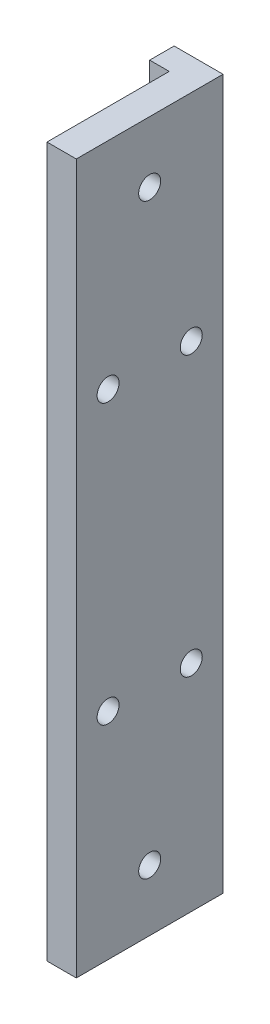
ISO-10303-21;
HEADER;
FILE_DESCRIPTION(('STEP AP214'),'2;1');
FILE_NAME('part.step','',(''),(''),'','','');
FILE_SCHEMA(('AUTOMOTIVE_DESIGN { 1 0 10303 214 1 1 1 1 }'));
ENDSEC;
DATA;
#1=APPLICATION_CONTEXT('core data for automotive mechanical design processes');
#2=APPLICATION_PROTOCOL_DEFINITION('international standard','automotive_design',2000,#1);
#3=PRODUCT_CONTEXT('',#1,'mechanical');
#4=PRODUCT('Part','Part','',(#3));
#5=PRODUCT_RELATED_PRODUCT_CATEGORY('part','',(#4));
#6=PRODUCT_DEFINITION_FORMATION('','',#4);
#7=PRODUCT_DEFINITION_CONTEXT('part definition',#1,'design');
#8=PRODUCT_DEFINITION('design','',#6,#7);
#9=PRODUCT_DEFINITION_SHAPE('','',#8);
#10=(LENGTH_UNIT() NAMED_UNIT(*) SI_UNIT(.MILLI.,.METRE.));
#11=(NAMED_UNIT(*) PLANE_ANGLE_UNIT() SI_UNIT($,.RADIAN.));
#12=(NAMED_UNIT(*) SI_UNIT($,.STERADIAN.) SOLID_ANGLE_UNIT());
#13=UNCERTAINTY_MEASURE_WITH_UNIT(LENGTH_MEASURE(1.E-05),#10,'distance_accuracy_value','');
#14=(GEOMETRIC_REPRESENTATION_CONTEXT(3) GLOBAL_UNCERTAINTY_ASSIGNED_CONTEXT((#13)) GLOBAL_UNIT_ASSIGNED_CONTEXT((#10,
#11,#12)) REPRESENTATION_CONTEXT('',''));
#15=CARTESIAN_POINT('',(0.,0.,0.));
#16=DIRECTION('',(0.,0.,1.));
#17=DIRECTION('',(1.,0.,0.));
#18=AXIS2_PLACEMENT_3D('',#15,#16,#17);
#19=CARTESIAN_POINT('',(-67.5000000000001,115.,102.5));
#20=DIRECTION('',(1.,0.,0.));
#21=DIRECTION('',(0.,0.,-1.));
#22=AXIS2_PLACEMENT_3D('',#19,#20,#21);
#23=PLANE('',#22);
#24=CARTESIAN_POINT('',(-67.5000000000001,159.,121.));
#25=DIRECTION('',(1.,0.,0.));
#26=DIRECTION('',(0.,0.,-1.));
#27=AXIS2_PLACEMENT_3D('',#24,#25,#26);
#28=CIRCLE('',#27,2.25);
#29=CARTESIAN_POINT('',(-67.5000000000001,159.,118.75));
#30=VERTEX_POINT('',#29);
#31=EDGE_CURVE('E180',#30,#30,#28,.T.);
#32=ORIENTED_EDGE('',*,*,#31,.T.);
#33=EDGE_LOOP('',(#32));
#34=FACE_BOUND('',#33,.T.);
#35=CARTESIAN_POINT('',(-67.5000000000001,216.,121.));
#36=DIRECTION('',(1.,0.,0.));
#37=DIRECTION('',(0.,0.,-1.));
#38=AXIS2_PLACEMENT_3D('',#35,#36,#37);
#39=CIRCLE('',#38,2.25);
#40=CARTESIAN_POINT('',(-67.5000000000001,216.,118.75));
#41=VERTEX_POINT('',#40);
#42=EDGE_CURVE('E214',#41,#41,#39,.T.);
#43=ORIENTED_EDGE('',*,*,#42,.T.);
#44=EDGE_LOOP('',(#43));
#45=FACE_BOUND('',#44,.T.);
#46=CARTESIAN_POINT('',(-67.5000000000001,247.5,112.5));
#47=DIRECTION('',(1.,0.,0.));
#48=DIRECTION('',(0.,0.,-1.));
#49=AXIS2_PLACEMENT_3D('',#46,#47,#48);
#50=CIRCLE('',#49,2.25);
#51=CARTESIAN_POINT('',(-67.5000000000001,247.5,110.25));
#52=VERTEX_POINT('',#51);
#53=EDGE_CURVE('E190',#52,#52,#50,.T.);
#54=ORIENTED_EDGE('',*,*,#53,.T.);
#55=EDGE_LOOP('',(#54));
#56=FACE_BOUND('',#55,.T.);
#57=CARTESIAN_POINT('',(-67.5000000000001,127.5,112.5));
#58=DIRECTION('',(1.,0.,0.));
#59=DIRECTION('',(0.,0.,-1.));
#60=AXIS2_PLACEMENT_3D('',#57,#58,#59);
#61=CIRCLE('',#60,2.25);
#62=CARTESIAN_POINT('',(-67.5000000000001,127.5,110.25));
#63=VERTEX_POINT('',#62);
#64=EDGE_CURVE('E44',#63,#63,#61,.T.);
#65=ORIENTED_EDGE('',*,*,#64,.T.);
#66=EDGE_LOOP('',(#65));
#67=FACE_BOUND('',#66,.T.);
#68=DIRECTION('',(0.,1.,0.));
#69=VECTOR('',#68,1.);
#70=CARTESIAN_POINT('',(-67.5000000000001,115.,102.5));
#71=LINE('',#70,#69);
#72=CARTESIAN_POINT('',(-67.5000000000001,217.677050983125,102.5));
#73=VERTEX_POINT('',#72);
#74=CARTESIAN_POINT('',(-67.5000000000001,260.,102.5));
#75=VERTEX_POINT('',#74);
#76=EDGE_CURVE('E50',#73,#75,#71,.T.);
#77=ORIENTED_EDGE('',*,*,#76,.F.);
#78=CARTESIAN_POINT('',(-67.5000000000001,216.,104.));
#79=DIRECTION('',(1.,0.,0.));
#80=DIRECTION('',(0.,0.,-1.));
#81=AXIS2_PLACEMENT_3D('',#78,#79,#80);
#82=CIRCLE('',#81,2.25);
#83=CARTESIAN_POINT('',(-67.5000000000001,214.322949016875,102.5));
#84=VERTEX_POINT('',#83);
#85=EDGE_CURVE('E56',#73,#84,#82,.T.);
#86=ORIENTED_EDGE('',*,*,#85,.T.);
#87=CARTESIAN_POINT('',(-67.5000000000001,160.677050983125,102.5));
#88=VERTEX_POINT('',#87);
#89=EDGE_CURVE('E166',#88,#84,#71,.T.);
#90=ORIENTED_EDGE('',*,*,#89,.F.);
#91=CARTESIAN_POINT('',(-67.5000000000001,159.,104.));
#92=DIRECTION('',(1.,0.,0.));
#93=DIRECTION('',(0.,0.,-1.));
#94=AXIS2_PLACEMENT_3D('',#91,#92,#93);
#95=CIRCLE('',#94,2.25);
#96=CARTESIAN_POINT('',(-67.5000000000001,157.322949016875,102.5));
#97=VERTEX_POINT('',#96);
#98=EDGE_CURVE('E63',#88,#97,#95,.T.);
#99=ORIENTED_EDGE('',*,*,#98,.T.);
#100=CARTESIAN_POINT('',(-67.5000000000001,115.,102.5));
#101=VERTEX_POINT('',#100);
#102=EDGE_CURVE('E11',#101,#97,#71,.T.);
#103=ORIENTED_EDGE('',*,*,#102,.F.);
#104=DIRECTION('',(0.,0.,-1.));
#105=VECTOR('',#104,1.);
#106=CARTESIAN_POINT('',(-67.5000000000001,115.,102.5));
#107=LINE('',#106,#105);
#108=CARTESIAN_POINT('',(-67.5000000000001,115.,127.5));
#109=VERTEX_POINT('',#108);
#110=EDGE_CURVE('E109',#109,#101,#107,.T.);
#111=ORIENTED_EDGE('',*,*,#110,.F.);
#112=DIRECTION('',(0.,1.,0.));
#113=VECTOR('',#112,1.);
#114=CARTESIAN_POINT('',(-67.5,115.,127.5));
#115=LINE('',#114,#113);
#116=CARTESIAN_POINT('',(-67.5,260.,127.5));
#117=VERTEX_POINT('',#116);
#118=EDGE_CURVE('E113',#109,#117,#115,.T.);
#119=ORIENTED_EDGE('',*,*,#118,.T.);
#120=DIRECTION('',(0.,0.,-1.));
#121=VECTOR('',#120,1.);
#122=CARTESIAN_POINT('',(-67.5000000000001,260.,102.5));
#123=LINE('',#122,#121);
#124=EDGE_CURVE('E141',#117,#75,#123,.T.);
#125=ORIENTED_EDGE('',*,*,#124,.T.);
#126=EDGE_LOOP('',(#77,#86,#90,#99,#103,#111,#119,#125));
#127=FACE_BOUND('',#126,.T.);
#128=ADVANCED_FACE('F41',(#34,#45,#56,#67,#127),#23,.F.);
#129=CARTESIAN_POINT('',(-71.5000000000001,115.,102.5));
#130=DIRECTION('',(0.,0.,-1.));
#131=DIRECTION('',(-1.,0.,0.));
#132=AXIS2_PLACEMENT_3D('',#129,#130,#131);
#133=PLANE('',#132);
#134=DIRECTION('',(-1.,0.,0.));
#135=VECTOR('',#134,1.);
#136=CARTESIAN_POINT('',(-71.5000000000001,260.,102.5));
#137=LINE('',#136,#135);
#138=CARTESIAN_POINT('',(-71.5000000000001,260.,102.5));
#139=VERTEX_POINT('',#138);
#140=EDGE_CURVE('E143',#75,#139,#137,.T.);
#141=ORIENTED_EDGE('',*,*,#140,.T.);
#142=DIRECTION('',(0.,1.,0.));
#143=VECTOR('',#142,1.);
#144=CARTESIAN_POINT('',(-71.5000000000001,115.,102.5));
#145=LINE('',#144,#143);
#146=CARTESIAN_POINT('',(-71.5000000000001,115.,102.5));
#147=VERTEX_POINT('',#146);
#148=EDGE_CURVE('E157',#147,#139,#145,.T.);
#149=ORIENTED_EDGE('',*,*,#148,.F.);
#150=DIRECTION('',(-1.,0.,0.));
#151=VECTOR('',#150,1.);
#152=CARTESIAN_POINT('',(-71.5000000000001,115.,102.5));
#153=LINE('',#152,#151);
#154=EDGE_CURVE('E118',#101,#147,#153,.T.);
#155=ORIENTED_EDGE('',*,*,#154,.F.);
#156=ORIENTED_EDGE('',*,*,#102,.T.);
#157=EDGE_CURVE('E49',#97,#88,#71,.T.);
#158=ORIENTED_EDGE('',*,*,#157,.T.);
#159=ORIENTED_EDGE('',*,*,#89,.T.);
#160=EDGE_CURVE('E163',#84,#73,#71,.T.);
#161=ORIENTED_EDGE('',*,*,#160,.T.);
#162=ORIENTED_EDGE('',*,*,#76,.T.);
#163=EDGE_LOOP('',(#141,#149,#155,#156,#158,#159,#161,#162));
#164=FACE_BOUND('',#163,.T.);
#165=ADVANCED_FACE('F170',(#164),#133,.F.);
#166=CARTESIAN_POINT('',(-71.5000000000001,115.,97.5));
#167=DIRECTION('',(1.,0.,0.));
#168=DIRECTION('',(0.,0.,-1.));
#169=AXIS2_PLACEMENT_3D('',#166,#167,#168);
#170=PLANE('',#169);
#171=DIRECTION('',(0.,0.,-1.));
#172=VECTOR('',#171,1.);
#173=CARTESIAN_POINT('',(-71.5000000000001,260.,97.5));
#174=LINE('',#173,#172);
#175=CARTESIAN_POINT('',(-71.5000000000001,260.,97.5));
#176=VERTEX_POINT('',#175);
#177=EDGE_CURVE('E145',#139,#176,#174,.T.);
#178=ORIENTED_EDGE('',*,*,#177,.T.);
#179=DIRECTION('',(0.,1.,0.));
#180=VECTOR('',#179,1.);
#181=CARTESIAN_POINT('',(-71.5000000000001,115.,97.5));
#182=LINE('',#181,#180);
#183=CARTESIAN_POINT('',(-71.5000000000001,115.,97.5));
#184=VERTEX_POINT('',#183);
#185=EDGE_CURVE('E154',#184,#176,#182,.T.);
#186=ORIENTED_EDGE('',*,*,#185,.F.);
#187=DIRECTION('',(0.,0.,-1.));
#188=VECTOR('',#187,1.);
#189=CARTESIAN_POINT('',(-71.5000000000001,115.,97.5));
#190=LINE('',#189,#188);
#191=EDGE_CURVE('E197',#147,#184,#190,.T.);
#192=ORIENTED_EDGE('',*,*,#191,.F.);
#193=ORIENTED_EDGE('',*,*,#148,.T.);
#194=EDGE_LOOP('',(#178,#186,#192,#193));
#195=FACE_BOUND('',#194,.T.);
#196=ADVANCED_FACE('F247',(#195),#170,.F.);
#197=CARTESIAN_POINT('',(-61.5000000000001,115.,97.5));
#198=DIRECTION('',(0.,0.,1.));
#199=DIRECTION('',(1.,0.,0.));
#200=AXIS2_PLACEMENT_3D('',#197,#198,#199);
#201=PLANE('',#200);
#202=DIRECTION('',(1.,0.,0.));
#203=VECTOR('',#202,1.);
#204=CARTESIAN_POINT('',(-61.5000000000001,260.,97.5));
#205=LINE('',#204,#203);
#206=CARTESIAN_POINT('',(-61.5000000000001,260.,97.5));
#207=VERTEX_POINT('',#206);
#208=EDGE_CURVE('E147',#176,#207,#205,.T.);
#209=ORIENTED_EDGE('',*,*,#208,.T.);
#210=DIRECTION('',(0.,1.,0.));
#211=VECTOR('',#210,1.);
#212=CARTESIAN_POINT('',(-61.5000000000001,115.,97.5));
#213=LINE('',#212,#211);
#214=CARTESIAN_POINT('',(-61.5000000000001,115.,97.5));
#215=VERTEX_POINT('',#214);
#216=EDGE_CURVE('E135',#215,#207,#213,.T.);
#217=ORIENTED_EDGE('',*,*,#216,.F.);
#218=DIRECTION('',(1.,0.,0.));
#219=VECTOR('',#218,1.);
#220=CARTESIAN_POINT('',(-61.5000000000001,115.,97.5));
#221=LINE('',#220,#219);
#222=EDGE_CURVE('E137',#184,#215,#221,.T.);
#223=ORIENTED_EDGE('',*,*,#222,.F.);
#224=ORIENTED_EDGE('',*,*,#185,.T.);
#225=EDGE_LOOP('',(#209,#217,#223,#224));
#226=FACE_BOUND('',#225,.T.);
#227=ADVANCED_FACE('F202',(#226),#201,.F.);
#228=CARTESIAN_POINT('',(-61.5000000000001,115.,127.5));
#229=DIRECTION('',(-1.,0.,0.));
#230=DIRECTION('',(0.,0.,1.));
#231=AXIS2_PLACEMENT_3D('',#228,#229,#230);
#232=PLANE('',#231);
#233=CARTESIAN_POINT('',(-61.5000000000001,216.,104.));
#234=DIRECTION('',(1.,0.,0.));
#235=DIRECTION('',(0.,0.,-1.));
#236=AXIS2_PLACEMENT_3D('',#233,#234,#235);
#237=CIRCLE('',#236,2.25);
#238=CARTESIAN_POINT('',(-61.5000000000001,216.,101.75));
#239=VERTEX_POINT('',#238);
#240=EDGE_CURVE('E127',#239,#239,#237,.T.);
#241=ORIENTED_EDGE('',*,*,#240,.F.);
#242=EDGE_LOOP('',(#241));
#243=FACE_BOUND('',#242,.T.);
#244=CARTESIAN_POINT('',(-61.5000000000001,216.,121.));
#245=DIRECTION('',(1.,0.,0.));
#246=DIRECTION('',(0.,0.,-1.));
#247=AXIS2_PLACEMENT_3D('',#244,#245,#246);
#248=CIRCLE('',#247,2.25);
#249=CARTESIAN_POINT('',(-61.5000000000001,216.,118.75));
#250=VERTEX_POINT('',#249);
#251=EDGE_CURVE('E210',#250,#250,#248,.T.);
#252=ORIENTED_EDGE('',*,*,#251,.F.);
#253=EDGE_LOOP('',(#252));
#254=FACE_BOUND('',#253,.T.);
#255=CARTESIAN_POINT('',(-61.5000000000001,159.,104.));
#256=DIRECTION('',(1.,0.,0.));
#257=DIRECTION('',(0.,0.,-1.));
#258=AXIS2_PLACEMENT_3D('',#255,#256,#257);
#259=CIRCLE('',#258,2.25);
#260=CARTESIAN_POINT('',(-61.5000000000001,159.,101.75));
#261=VERTEX_POINT('',#260);
#262=EDGE_CURVE('E176',#261,#261,#259,.T.);
#263=ORIENTED_EDGE('',*,*,#262,.F.);
#264=EDGE_LOOP('',(#263));
#265=FACE_BOUND('',#264,.T.);
#266=CARTESIAN_POINT('',(-61.5000000000001,159.,121.));
#267=DIRECTION('',(1.,0.,0.));
#268=DIRECTION('',(0.,0.,-1.));
#269=AXIS2_PLACEMENT_3D('',#266,#267,#268);
#270=CIRCLE('',#269,2.25);
#271=CARTESIAN_POINT('',(-61.5000000000001,159.,118.75));
#272=VERTEX_POINT('',#271);
#273=EDGE_CURVE('E178',#272,#272,#270,.T.);
#274=ORIENTED_EDGE('',*,*,#273,.F.);
#275=EDGE_LOOP('',(#274));
#276=FACE_BOUND('',#275,.T.);
#277=CARTESIAN_POINT('',(-61.5000000000001,247.5,112.5));
#278=DIRECTION('',(1.,0.,0.));
#279=DIRECTION('',(0.,0.,-1.));
#280=AXIS2_PLACEMENT_3D('',#277,#278,#279);
#281=CIRCLE('',#280,2.25);
#282=CARTESIAN_POINT('',(-61.5000000000001,247.5,110.25));
#283=VERTEX_POINT('',#282);
#284=EDGE_CURVE('E187',#283,#283,#281,.T.);
#285=ORIENTED_EDGE('',*,*,#284,.F.);
#286=EDGE_LOOP('',(#285));
#287=FACE_BOUND('',#286,.T.);
#288=CARTESIAN_POINT('',(-61.5000000000001,127.5,112.5));
#289=DIRECTION('',(1.,0.,0.));
#290=DIRECTION('',(0.,0.,-1.));
#291=AXIS2_PLACEMENT_3D('',#288,#289,#290);
#292=CIRCLE('',#291,2.25);
#293=CARTESIAN_POINT('',(-61.5000000000001,127.5,110.25));
#294=VERTEX_POINT('',#293);
#295=EDGE_CURVE('E193',#294,#294,#292,.T.);
#296=ORIENTED_EDGE('',*,*,#295,.F.);
#297=EDGE_LOOP('',(#296));
#298=FACE_BOUND('',#297,.T.);
#299=DIRECTION('',(0.,0.,1.));
#300=VECTOR('',#299,1.);
#301=CARTESIAN_POINT('',(-61.5000000000001,260.,127.5));
#302=LINE('',#301,#300);
#303=CARTESIAN_POINT('',(-61.5000000000001,260.,127.5));
#304=VERTEX_POINT('',#303);
#305=EDGE_CURVE('E149',#207,#304,#302,.T.);
#306=ORIENTED_EDGE('',*,*,#305,.T.);
#307=DIRECTION('',(0.,1.,0.));
#308=VECTOR('',#307,1.);
#309=CARTESIAN_POINT('',(-61.5000000000001,115.,127.5));
#310=LINE('',#309,#308);
#311=CARTESIAN_POINT('',(-61.5000000000001,115.,127.5));
#312=VERTEX_POINT('',#311);
#313=EDGE_CURVE('E133',#312,#304,#310,.T.);
#314=ORIENTED_EDGE('',*,*,#313,.F.);
#315=DIRECTION('',(0.,0.,1.));
#316=VECTOR('',#315,1.);
#317=CARTESIAN_POINT('',(-61.5000000000001,115.,127.5));
#318=LINE('',#317,#316);
#319=EDGE_CURVE('E131',#215,#312,#318,.T.);
#320=ORIENTED_EDGE('',*,*,#319,.F.);
#321=ORIENTED_EDGE('',*,*,#216,.T.);
#322=EDGE_LOOP('',(#306,#314,#320,#321));
#323=FACE_BOUND('',#322,.T.);
#324=ADVANCED_FACE('F206',(#243,#254,#265,#276,#287,#298,#323),#232,.F.);
#325=CARTESIAN_POINT('',(-71.5,115.,127.5));
#326=DIRECTION('',(0.,0.,-1.));
#327=DIRECTION('',(-1.,0.,0.));
#328=AXIS2_PLACEMENT_3D('',#325,#326,#327);
#329=PLANE('',#328);
#330=DIRECTION('',(-1.,0.,0.));
#331=VECTOR('',#330,1.);
#332=CARTESIAN_POINT('',(-71.5,260.,127.5));
#333=LINE('',#332,#331);
#334=EDGE_CURVE('E119',#304,#117,#333,.T.);
#335=ORIENTED_EDGE('',*,*,#334,.T.);
#336=ORIENTED_EDGE('',*,*,#118,.F.);
#337=DIRECTION('',(-1.,0.,0.));
#338=VECTOR('',#337,1.);
#339=CARTESIAN_POINT('',(-71.5,115.,127.5));
#340=LINE('',#339,#338);
#341=EDGE_CURVE('E125',#312,#109,#340,.T.);
#342=ORIENTED_EDGE('',*,*,#341,.F.);
#343=ORIENTED_EDGE('',*,*,#313,.T.);
#344=EDGE_LOOP('',(#335,#336,#342,#343));
#345=FACE_BOUND('',#344,.T.);
#346=ADVANCED_FACE('F123',(#345),#329,.F.);
#347=CARTESIAN_POINT('',(0.,115.,0.));
#348=DIRECTION('',(0.,1.,0.));
#349=DIRECTION('',(0.,0.,1.));
#350=AXIS2_PLACEMENT_3D('',#347,#348,#349);
#351=PLANE('',#350);
#352=ORIENTED_EDGE('',*,*,#341,.T.);
#353=ORIENTED_EDGE('',*,*,#110,.T.);
#354=ORIENTED_EDGE('',*,*,#154,.T.);
#355=ORIENTED_EDGE('',*,*,#191,.T.);
#356=ORIENTED_EDGE('',*,*,#222,.T.);
#357=ORIENTED_EDGE('',*,*,#319,.T.);
#358=EDGE_LOOP('',(#352,#353,#354,#355,#356,#357));
#359=FACE_BOUND('',#358,.T.);
#360=ADVANCED_FACE('F129',(#359),#351,.F.);
#361=CARTESIAN_POINT('',(0.,260.,0.));
#362=DIRECTION('',(0.,1.,0.));
#363=DIRECTION('',(0.,0.,1.));
#364=AXIS2_PLACEMENT_3D('',#361,#362,#363);
#365=PLANE('',#364);
#366=ORIENTED_EDGE('',*,*,#124,.F.);
#367=ORIENTED_EDGE('',*,*,#334,.F.);
#368=ORIENTED_EDGE('',*,*,#305,.F.);
#369=ORIENTED_EDGE('',*,*,#208,.F.);
#370=ORIENTED_EDGE('',*,*,#177,.F.);
#371=ORIENTED_EDGE('',*,*,#140,.F.);
#372=EDGE_LOOP('',(#366,#367,#368,#369,#370,#371));
#373=FACE_BOUND('',#372,.T.);
#374=ADVANCED_FACE('F208',(#373),#365,.T.);
#375=CARTESIAN_POINT('',(-61.5000000000001,127.5,112.5));
#376=DIRECTION('',(1.,0.,0.));
#377=DIRECTION('',(0.,0.,-1.));
#378=AXIS2_PLACEMENT_3D('',#375,#376,#377);
#379=CYLINDRICAL_SURFACE('',#378,2.25);
#380=ORIENTED_EDGE('',*,*,#295,.T.);
#381=EDGE_LOOP('',(#380));
#382=FACE_BOUND('',#381,.T.);
#383=ORIENTED_EDGE('',*,*,#64,.F.);
#384=EDGE_LOOP('',(#383));
#385=FACE_BOUND('',#384,.T.);
#386=ADVANCED_FACE('F233',(#382,#385),#379,.F.);
#387=CARTESIAN_POINT('',(-61.5000000000001,247.5,112.5));
#388=DIRECTION('',(1.,0.,0.));
#389=DIRECTION('',(0.,0.,-1.));
#390=AXIS2_PLACEMENT_3D('',#387,#388,#389);
#391=CYLINDRICAL_SURFACE('',#390,2.25);
#392=ORIENTED_EDGE('',*,*,#284,.T.);
#393=EDGE_LOOP('',(#392));
#394=FACE_BOUND('',#393,.T.);
#395=ORIENTED_EDGE('',*,*,#53,.F.);
#396=EDGE_LOOP('',(#395));
#397=FACE_BOUND('',#396,.T.);
#398=ADVANCED_FACE('F236',(#394,#397),#391,.F.);
#399=CARTESIAN_POINT('',(-61.5000000000001,159.,121.));
#400=DIRECTION('',(1.,0.,0.));
#401=DIRECTION('',(0.,0.,-1.));
#402=AXIS2_PLACEMENT_3D('',#399,#400,#401);
#403=CYLINDRICAL_SURFACE('',#402,2.25);
#404=ORIENTED_EDGE('',*,*,#31,.F.);
#405=EDGE_LOOP('',(#404));
#406=FACE_BOUND('',#405,.T.);
#407=ORIENTED_EDGE('',*,*,#273,.T.);
#408=EDGE_LOOP('',(#407));
#409=FACE_BOUND('',#408,.T.);
#410=ADVANCED_FACE('F253',(#406,#409),#403,.F.);
#411=CARTESIAN_POINT('',(-67.5000000000001,159.,104.));
#412=DIRECTION('',(-1.,0.,0.));
#413=DIRECTION('',(0.,0.,1.));
#414=AXIS2_PLACEMENT_3D('',#411,#412,#413);
#415=PLANE('',#414);
#416=EDGE_CURVE('E173',#97,#88,#95,.T.);
#417=ORIENTED_EDGE('',*,*,#416,.T.);
#418=ORIENTED_EDGE('',*,*,#157,.F.);
#419=EDGE_LOOP('',(#417,#418));
#420=FACE_BOUND('',#419,.T.);
#421=ADVANCED_FACE('F172',(#420),#415,.F.);
#422=CARTESIAN_POINT('',(-61.5000000000001,159.,104.));
#423=DIRECTION('',(1.,0.,0.));
#424=DIRECTION('',(0.,0.,-1.));
#425=AXIS2_PLACEMENT_3D('',#422,#423,#424);
#426=CYLINDRICAL_SURFACE('',#425,2.25);
#427=ORIENTED_EDGE('',*,*,#98,.F.);
#428=ORIENTED_EDGE('',*,*,#416,.F.);
#429=EDGE_LOOP('',(#427,#428));
#430=FACE_BOUND('',#429,.T.);
#431=ORIENTED_EDGE('',*,*,#262,.T.);
#432=EDGE_LOOP('',(#431));
#433=FACE_BOUND('',#432,.T.);
#434=ADVANCED_FACE('F174',(#430,#433),#426,.F.);
#435=CARTESIAN_POINT('',(-61.5000000000001,216.,121.));
#436=DIRECTION('',(1.,0.,0.));
#437=DIRECTION('',(0.,0.,-1.));
#438=AXIS2_PLACEMENT_3D('',#435,#436,#437);
#439=CYLINDRICAL_SURFACE('',#438,2.25);
#440=ORIENTED_EDGE('',*,*,#42,.F.);
#441=EDGE_LOOP('',(#440));
#442=FACE_BOUND('',#441,.T.);
#443=ORIENTED_EDGE('',*,*,#251,.T.);
#444=EDGE_LOOP('',(#443));
#445=FACE_BOUND('',#444,.T.);
#446=ADVANCED_FACE('F343',(#442,#445),#439,.F.);
#447=CARTESIAN_POINT('',(-67.5000000000001,216.,104.));
#448=DIRECTION('',(-1.,0.,0.));
#449=DIRECTION('',(0.,0.,1.));
#450=AXIS2_PLACEMENT_3D('',#447,#448,#449);
#451=PLANE('',#450);
#452=EDGE_CURVE('E211',#84,#73,#82,.T.);
#453=ORIENTED_EDGE('',*,*,#452,.T.);
#454=ORIENTED_EDGE('',*,*,#160,.F.);
#455=EDGE_LOOP('',(#453,#454));
#456=FACE_BOUND('',#455,.T.);
#457=ADVANCED_FACE('F354',(#456),#451,.F.);
#458=CARTESIAN_POINT('',(-61.5000000000001,216.,104.));
#459=DIRECTION('',(1.,0.,0.));
#460=DIRECTION('',(0.,0.,-1.));
#461=AXIS2_PLACEMENT_3D('',#458,#459,#460);
#462=CYLINDRICAL_SURFACE('',#461,2.25);
#463=ORIENTED_EDGE('',*,*,#85,.F.);
#464=ORIENTED_EDGE('',*,*,#452,.F.);
#465=EDGE_LOOP('',(#463,#464));
#466=FACE_BOUND('',#465,.T.);
#467=ORIENTED_EDGE('',*,*,#240,.T.);
#468=EDGE_LOOP('',(#467));
#469=FACE_BOUND('',#468,.T.);
#470=ADVANCED_FACE('F364',(#466,#469),#462,.F.);
#471=CLOSED_SHELL('',(#128,#165,#196,#227,#324,#346,#360,#374,#386,#398,#410,#421,#434,#446,
#457,#470));
#472=MANIFOLD_SOLID_BREP('B2',#471);
#473=ADVANCED_BREP_SHAPE_REPRESENTATION('',(#18,#472),#14);
#474=SHAPE_DEFINITION_REPRESENTATION(#9,#473);
ENDSEC;
END-ISO-10303-21;
